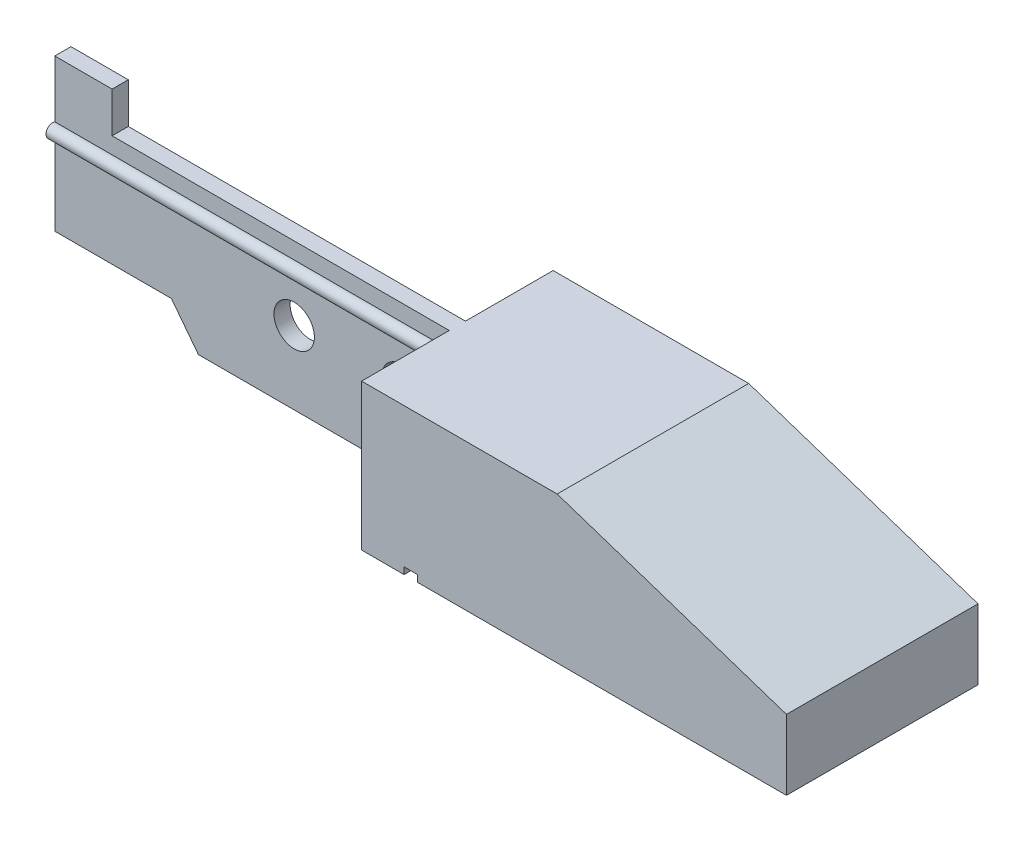
ISO-10303-21;
HEADER;
FILE_DESCRIPTION(('STEP AP214'),'2;1');
FILE_NAME('part.step','',(''),(''),'','','');
FILE_SCHEMA(('AUTOMOTIVE_DESIGN { 1 0 10303 214 1 1 1 1 }'));
ENDSEC;
DATA;
#1=APPLICATION_CONTEXT('core data for automotive mechanical design processes');
#2=APPLICATION_PROTOCOL_DEFINITION('international standard','automotive_design',2000,#1);
#3=PRODUCT_CONTEXT('',#1,'mechanical');
#4=PRODUCT('Part','Part','',(#3));
#5=PRODUCT_RELATED_PRODUCT_CATEGORY('part','',(#4));
#6=PRODUCT_DEFINITION_FORMATION('','',#4);
#7=PRODUCT_DEFINITION_CONTEXT('part definition',#1,'design');
#8=PRODUCT_DEFINITION('design','',#6,#7);
#9=PRODUCT_DEFINITION_SHAPE('','',#8);
#10=(LENGTH_UNIT() NAMED_UNIT(*) SI_UNIT(.MILLI.,.METRE.));
#11=(NAMED_UNIT(*) PLANE_ANGLE_UNIT() SI_UNIT($,.RADIAN.));
#12=(NAMED_UNIT(*) SI_UNIT($,.STERADIAN.) SOLID_ANGLE_UNIT());
#13=UNCERTAINTY_MEASURE_WITH_UNIT(LENGTH_MEASURE(1.E-05),#10,'distance_accuracy_value','');
#14=(GEOMETRIC_REPRESENTATION_CONTEXT(3) GLOBAL_UNCERTAINTY_ASSIGNED_CONTEXT((#13)) GLOBAL_UNIT_ASSIGNED_CONTEXT((#10,
#11,#12)) REPRESENTATION_CONTEXT('',''));
#15=CARTESIAN_POINT('',(0.,0.,0.));
#16=DIRECTION('',(0.,0.,1.));
#17=DIRECTION('',(1.,0.,0.));
#18=AXIS2_PLACEMENT_3D('',#15,#16,#17);
#19=CARTESIAN_POINT('',(-66.1286595394737,20.06375,7.7));
#20=DIRECTION('',(0.,0.,-1.));
#21=DIRECTION('',(0.,1.,0.));
#22=AXIS2_PLACEMENT_3D('',#19,#20,#21);
#23=PLANE('',#22);
#24=DIRECTION('',(1.,0.,0.));
#25=VECTOR('',#24,1.);
#26=CARTESIAN_POINT('',(-67.5428731018468,18.8407196007085,7.7));
#27=LINE('',#26,#25);
#28=CARTESIAN_POINT('',(-36.8786595394737,18.8407196007085,7.7));
#29=VERTEX_POINT('',#28);
#30=CARTESIAN_POINT('',(-66.1286595394737,18.8407196007085,7.7));
#31=VERTEX_POINT('',#30);
#32=EDGE_CURVE('E353',#29,#31,#27,.F.);
#33=ORIENTED_EDGE('',*,*,#32,.F.);
#34=DIRECTION('',(0.,1.,0.));
#35=VECTOR('',#34,1.);
#36=CARTESIAN_POINT('',(-36.8786595394737,20.06375,7.7));
#37=LINE('',#36,#35);
#38=CARTESIAN_POINT('',(-36.8786595394737,20.06375,7.7));
#39=VERTEX_POINT('',#38);
#40=EDGE_CURVE('E188',#29,#39,#37,.T.);
#41=ORIENTED_EDGE('',*,*,#40,.T.);
#42=DIRECTION('',(1.,0.,0.));
#43=VECTOR('',#42,1.);
#44=CARTESIAN_POINT('',(-66.1286595394737,20.06375,7.7));
#45=LINE('',#44,#43);
#46=CARTESIAN_POINT('',(-61.8772092607855,20.06375,7.7));
#47=VERTEX_POINT('',#46);
#48=EDGE_CURVE('E194',#47,#39,#45,.T.);
#49=ORIENTED_EDGE('',*,*,#48,.F.);
#50=DIRECTION('',(0.,-1.,0.));
#51=VECTOR('',#50,1.);
#52=CARTESIAN_POINT('',(-61.8772092607855,23.06375,7.7));
#53=LINE('',#52,#51);
#54=CARTESIAN_POINT('',(-61.8772092607855,23.06375,7.7));
#55=VERTEX_POINT('',#54);
#56=EDGE_CURVE('E191',#55,#47,#53,.T.);
#57=ORIENTED_EDGE('',*,*,#56,.F.);
#58=DIRECTION('',(1.,0.,0.));
#59=VECTOR('',#58,1.);
#60=CARTESIAN_POINT('',(-61.8772092607855,23.06375,7.7));
#61=LINE('',#60,#59);
#62=CARTESIAN_POINT('',(-66.1286595394737,23.06375,7.7));
#63=VERTEX_POINT('',#62);
#64=EDGE_CURVE('E311',#63,#55,#61,.T.);
#65=ORIENTED_EDGE('',*,*,#64,.F.);
#66=DIRECTION('',(0.,1.,0.));
#67=VECTOR('',#66,1.);
#68=CARTESIAN_POINT('',(-66.1286595394737,20.06375,7.7));
#69=LINE('',#68,#67);
#70=EDGE_CURVE('E182',#31,#63,#69,.T.);
#71=ORIENTED_EDGE('',*,*,#70,.F.);
#72=EDGE_LOOP('',(#33,#41,#49,#57,#65,#71));
#73=FACE_BOUND('',#72,.T.);
#74=ADVANCED_FACE('F34',(#73),#23,.F.);
#75=CARTESIAN_POINT('',(-48.3786595394737,14.63375,7.7));
#76=DIRECTION('',(0.,0.,-1.));
#77=DIRECTION('',(0.,1.,0.));
#78=AXIS2_PLACEMENT_3D('',#75,#76,#77);
#79=CIRCLE('',#78,1.5);
#80=CARTESIAN_POINT('',(-48.3786595394737,16.13375,7.7));
#81=VERTEX_POINT('',#80);
#82=EDGE_CURVE('E176',#81,#81,#79,.T.);
#83=ORIENTED_EDGE('',*,*,#82,.T.);
#84=EDGE_LOOP('',(#83));
#85=FACE_BOUND('',#84,.T.);
#86=CARTESIAN_POINT('',(-40.3786595394737,14.63375,7.7));
#87=DIRECTION('',(0.,0.,1.));
#88=DIRECTION('',(1.,0.,0.));
#89=AXIS2_PLACEMENT_3D('',#86,#87,#88);
#90=CIRCLE('',#89,1.5);
#91=CARTESIAN_POINT('',(-38.8786595394737,14.63375,7.7));
#92=VERTEX_POINT('',#91);
#93=EDGE_CURVE('E301',#92,#92,#90,.T.);
#94=ORIENTED_EDGE('',*,*,#93,.F.);
#95=EDGE_LOOP('',(#94));
#96=FACE_BOUND('',#95,.T.);
#97=DIRECTION('',(1.,0.,0.));
#98=VECTOR('',#97,1.);
#99=CARTESIAN_POINT('',(-66.1286595394737,11.81375,7.7));
#100=LINE('',#99,#98);
#101=CARTESIAN_POINT('',(-66.1286595394737,11.81375,7.7));
#102=VERTEX_POINT('',#101);
#103=CARTESIAN_POINT('',(-57.4786595394737,11.81375,7.7));
#104=VERTEX_POINT('',#103);
#105=EDGE_CURVE('E48',#102,#104,#100,.T.);
#106=ORIENTED_EDGE('',*,*,#105,.T.);
#107=DIRECTION('',(0.609710760849695,-0.792623989104598,0.));
#108=VECTOR('',#107,1.);
#109=CARTESIAN_POINT('',(-64.681261769957,21.1771328996282,7.7));
#110=LINE('',#109,#108);
#111=CARTESIAN_POINT('',(-55.4786595394737,9.21375,7.7));
#112=VERTEX_POINT('',#111);
#113=EDGE_CURVE('E363',#104,#112,#110,.T.);
#114=ORIENTED_EDGE('',*,*,#113,.T.);
#115=DIRECTION('',(1.,0.,0.));
#116=VECTOR('',#115,1.);
#117=CARTESIAN_POINT('',(-66.1286595394737,9.21375,7.7));
#118=LINE('',#117,#116);
#119=CARTESIAN_POINT('',(-36.8786595394737,9.21375,7.7));
#120=VERTEX_POINT('',#119);
#121=EDGE_CURVE('E200',#112,#120,#118,.T.);
#122=ORIENTED_EDGE('',*,*,#121,.T.);
#123=CARTESIAN_POINT('',(-36.8786595394737,17.8867803992915,7.7));
#124=VERTEX_POINT('',#123);
#125=EDGE_CURVE('E183',#120,#124,#37,.T.);
#126=ORIENTED_EDGE('',*,*,#125,.T.);
#127=DIRECTION('',(1.,0.,0.));
#128=VECTOR('',#127,1.);
#129=CARTESIAN_POINT('',(-67.5428731018468,17.8867803992915,7.7));
#130=LINE('',#129,#128);
#131=CARTESIAN_POINT('',(-66.1286595394737,17.8867803992915,7.7));
#132=VERTEX_POINT('',#131);
#133=EDGE_CURVE('E358',#132,#124,#130,.T.);
#134=ORIENTED_EDGE('',*,*,#133,.F.);
#135=EDGE_CURVE('E185',#102,#132,#69,.T.);
#136=ORIENTED_EDGE('',*,*,#135,.F.);
#137=EDGE_LOOP('',(#106,#114,#122,#126,#134,#136));
#138=FACE_BOUND('',#137,.T.);
#139=ADVANCED_FACE('F400',(#85,#96,#138),#23,.F.);
#140=CARTESIAN_POINT('',(-36.8786595394737,9.21375,14.2));
#141=DIRECTION('',(0.,1.,0.));
#142=DIRECTION('',(0.,0.,1.));
#143=AXIS2_PLACEMENT_3D('',#140,#141,#142);
#144=PLANE('',#143);
#145=ORIENTED_EDGE('',*,*,#121,.F.);
#146=DIRECTION('',(0.,0.,-1.));
#147=VECTOR('',#146,1.);
#148=CARTESIAN_POINT('',(-55.4786595394737,9.21375,16.5));
#149=LINE('',#148,#147);
#150=CARTESIAN_POINT('',(-55.4786595394737,9.21375,6.5));
#151=VERTEX_POINT('',#150);
#152=EDGE_CURVE('E367',#112,#151,#149,.T.);
#153=ORIENTED_EDGE('',*,*,#152,.T.);
#154=DIRECTION('',(1.,0.,0.));
#155=VECTOR('',#154,1.);
#156=CARTESIAN_POINT('',(-66.1286595394737,9.21375,6.5));
#157=LINE('',#156,#155);
#158=CARTESIAN_POINT('',(-36.8786595394737,9.21375,6.5));
#159=VERTEX_POINT('',#158);
#160=EDGE_CURVE('E202',#151,#159,#157,.T.);
#161=ORIENTED_EDGE('',*,*,#160,.T.);
#162=DIRECTION('',(0.,0.,-1.));
#163=VECTOR('',#162,1.);
#164=CARTESIAN_POINT('',(-36.8786595394737,9.21375,14.2));
#165=LINE('',#164,#163);
#166=CARTESIAN_POINT('',(-36.8786595394737,9.21375,0.));
#167=VERTEX_POINT('',#166);
#168=EDGE_CURVE('E245',#159,#167,#165,.T.);
#169=ORIENTED_EDGE('',*,*,#168,.T.);
#170=DIRECTION('',(1.,0.,0.));
#171=VECTOR('',#170,1.);
#172=CARTESIAN_POINT('',(-36.8786595394737,9.21375,0.));
#173=LINE('',#172,#171);
#174=CARTESIAN_POINT('',(-33.7292463448552,9.21375,0.));
#175=VERTEX_POINT('',#174);
#176=EDGE_CURVE('E225',#167,#175,#173,.T.);
#177=ORIENTED_EDGE('',*,*,#176,.T.);
#178=DIRECTION('',(0.,0.,-1.));
#179=VECTOR('',#178,1.);
#180=CARTESIAN_POINT('',(-33.7292463448552,9.21375,6.36936480338992));
#181=LINE('',#180,#179);
#182=CARTESIAN_POINT('',(-33.7292463448552,9.21375,14.2));
#183=VERTEX_POINT('',#182);
#184=EDGE_CURVE('E352',#183,#175,#181,.T.);
#185=ORIENTED_EDGE('',*,*,#184,.F.);
#186=DIRECTION('',(1.,0.,0.));
#187=VECTOR('',#186,1.);
#188=CARTESIAN_POINT('',(-36.8786595394737,9.21375,14.2));
#189=LINE('',#188,#187);
#190=CARTESIAN_POINT('',(-36.8786595394737,9.21375,14.2));
#191=VERTEX_POINT('',#190);
#192=EDGE_CURVE('E212',#191,#183,#189,.T.);
#193=ORIENTED_EDGE('',*,*,#192,.F.);
#194=EDGE_CURVE('E42',#191,#120,#165,.T.);
#195=ORIENTED_EDGE('',*,*,#194,.T.);
#196=EDGE_LOOP('',(#145,#153,#161,#169,#177,#185,#193,#195));
#197=FACE_BOUND('',#196,.T.);
#198=ADVANCED_FACE('F252',(#197),#144,.F.);
#199=CARTESIAN_POINT('',(-36.8786595394737,20.06375,14.2));
#200=DIRECTION('',(0.,-1.,0.));
#201=DIRECTION('',(0.,0.,-1.));
#202=AXIS2_PLACEMENT_3D('',#199,#200,#201);
#203=PLANE('',#202);
#204=DIRECTION('',(0.,0.,-1.));
#205=VECTOR('',#204,1.);
#206=CARTESIAN_POINT('',(-61.8772092607855,20.06375,7.7));
#207=LINE('',#206,#205);
#208=CARTESIAN_POINT('',(-61.8772092607855,20.06375,6.5));
#209=VERTEX_POINT('',#208);
#210=EDGE_CURVE('E307',#47,#209,#207,.T.);
#211=ORIENTED_EDGE('',*,*,#210,.F.);
#212=ORIENTED_EDGE('',*,*,#48,.T.);
#213=DIRECTION('',(0.,0.,-1.));
#214=VECTOR('',#213,1.);
#215=CARTESIAN_POINT('',(-36.8786595394737,20.06375,14.2));
#216=LINE('',#215,#214);
#217=CARTESIAN_POINT('',(-36.8786595394737,20.06375,14.2));
#218=VERTEX_POINT('',#217);
#219=EDGE_CURVE('E234',#218,#39,#216,.T.);
#220=ORIENTED_EDGE('',*,*,#219,.F.);
#221=DIRECTION('',(-1.,0.,0.));
#222=VECTOR('',#221,1.);
#223=CARTESIAN_POINT('',(-36.8786595394737,20.06375,14.2));
#224=LINE('',#223,#222);
#225=CARTESIAN_POINT('',(-22.3786595394737,20.06375,14.2));
#226=VERTEX_POINT('',#225);
#227=EDGE_CURVE('E219',#226,#218,#224,.T.);
#228=ORIENTED_EDGE('',*,*,#227,.F.);
#229=DIRECTION('',(0.,0.,-1.));
#230=VECTOR('',#229,1.);
#231=CARTESIAN_POINT('',(-22.3786595394737,20.06375,14.2));
#232=LINE('',#231,#230);
#233=CARTESIAN_POINT('',(-22.3786595394737,20.06375,0.));
#234=VERTEX_POINT('',#233);
#235=EDGE_CURVE('E237',#226,#234,#232,.T.);
#236=ORIENTED_EDGE('',*,*,#235,.T.);
#237=DIRECTION('',(-1.,0.,0.));
#238=VECTOR('',#237,1.);
#239=CARTESIAN_POINT('',(-36.8786595394737,20.06375,0.));
#240=LINE('',#239,#238);
#241=CARTESIAN_POINT('',(-36.8786595394737,20.06375,0.));
#242=VERTEX_POINT('',#241);
#243=EDGE_CURVE('E211',#234,#242,#240,.T.);
#244=ORIENTED_EDGE('',*,*,#243,.T.);
#245=CARTESIAN_POINT('',(-36.8786595394737,20.06375,6.5));
#246=VERTEX_POINT('',#245);
#247=EDGE_CURVE('E221',#246,#242,#216,.T.);
#248=ORIENTED_EDGE('',*,*,#247,.F.);
#249=DIRECTION('',(1.,0.,0.));
#250=VECTOR('',#249,1.);
#251=CARTESIAN_POINT('',(-66.1286595394737,20.06375,6.5));
#252=LINE('',#251,#250);
#253=EDGE_CURVE('E204',#209,#246,#252,.T.);
#254=ORIENTED_EDGE('',*,*,#253,.F.);
#255=EDGE_LOOP('',(#211,#212,#220,#228,#236,#244,#248,#254));
#256=FACE_BOUND('',#255,.T.);
#257=ADVANCED_FACE('F268',(#256),#203,.F.);
#258=CARTESIAN_POINT('',(-36.8786595394737,9.21375,14.2));
#259=DIRECTION('',(1.,0.,0.));
#260=DIRECTION('',(0.,0.,-1.));
#261=AXIS2_PLACEMENT_3D('',#258,#259,#260);
#262=PLANE('',#261);
#263=CARTESIAN_POINT('',(-36.8786595394737,18.36375,7.85));
#264=DIRECTION('',(-1.,0.,0.));
#265=DIRECTION('',(0.,0.,1.));
#266=AXIS2_PLACEMENT_3D('',#263,#264,#265);
#267=CIRCLE('',#266,0.500000000000001);
#268=EDGE_CURVE('E361',#124,#29,#267,.T.);
#269=ORIENTED_EDGE('',*,*,#268,.F.);
#270=ORIENTED_EDGE('',*,*,#125,.F.);
#271=ORIENTED_EDGE('',*,*,#194,.F.);
#272=DIRECTION('',(0.,-1.,0.));
#273=VECTOR('',#272,1.);
#274=CARTESIAN_POINT('',(-36.8786595394737,9.21375,14.2));
#275=LINE('',#274,#273);
#276=EDGE_CURVE('E207',#218,#191,#275,.T.);
#277=ORIENTED_EDGE('',*,*,#276,.F.);
#278=ORIENTED_EDGE('',*,*,#219,.T.);
#279=ORIENTED_EDGE('',*,*,#40,.F.);
#280=EDGE_LOOP('',(#269,#270,#271,#277,#278,#279));
#281=FACE_BOUND('',#280,.T.);
#282=ADVANCED_FACE('F36',(#281),#262,.F.);
#283=DIRECTION('',(0.,-1.,0.));
#284=VECTOR('',#283,1.);
#285=CARTESIAN_POINT('',(-36.8786595394737,20.06375,6.5));
#286=LINE('',#285,#284);
#287=EDGE_CURVE('E195',#246,#159,#286,.T.);
#288=ORIENTED_EDGE('',*,*,#287,.F.);
#289=ORIENTED_EDGE('',*,*,#247,.T.);
#290=DIRECTION('',(0.,-1.,0.));
#291=VECTOR('',#290,1.);
#292=CARTESIAN_POINT('',(-36.8786595394737,9.21375,0.));
#293=LINE('',#292,#291);
#294=EDGE_CURVE('E206',#242,#167,#293,.T.);
#295=ORIENTED_EDGE('',*,*,#294,.T.);
#296=ORIENTED_EDGE('',*,*,#168,.F.);
#297=EDGE_LOOP('',(#288,#289,#295,#296));
#298=FACE_BOUND('',#297,.T.);
#299=ADVANCED_FACE('F265',(#298),#262,.F.);
#300=CARTESIAN_POINT('',(-32.7292463448552,9.21375,14.2));
#301=VERTEX_POINT('',#300);
#302=CARTESIAN_POINT('',(-5.37865953947368,9.21375,14.2));
#303=VERTEX_POINT('',#302);
#304=EDGE_CURVE('E210',#301,#303,#189,.T.);
#305=ORIENTED_EDGE('',*,*,#304,.F.);
#306=DIRECTION('',(0.,0.,1.));
#307=VECTOR('',#306,1.);
#308=CARTESIAN_POINT('',(-32.7292463448552,9.21375,14.2));
#309=LINE('',#308,#307);
#310=CARTESIAN_POINT('',(-32.7292463448552,9.21375,0.));
#311=VERTEX_POINT('',#310);
#312=EDGE_CURVE('E286',#311,#301,#309,.T.);
#313=ORIENTED_EDGE('',*,*,#312,.F.);
#314=CARTESIAN_POINT('',(-5.37865953947368,9.21375,0.));
#315=VERTEX_POINT('',#314);
#316=EDGE_CURVE('E224',#311,#315,#173,.T.);
#317=ORIENTED_EDGE('',*,*,#316,.T.);
#318=DIRECTION('',(0.,0.,-1.));
#319=VECTOR('',#318,1.);
#320=CARTESIAN_POINT('',(-5.37865953947368,9.21375,14.2));
#321=LINE('',#320,#319);
#322=EDGE_CURVE('E243',#303,#315,#321,.T.);
#323=ORIENTED_EDGE('',*,*,#322,.F.);
#324=EDGE_LOOP('',(#305,#313,#317,#323));
#325=FACE_BOUND('',#324,.T.);
#326=ADVANCED_FACE('F284',(#325),#144,.F.);
#327=CARTESIAN_POINT('',(-5.37865953947368,9.21375,14.2));
#328=DIRECTION('',(-1.,0.,0.));
#329=DIRECTION('',(0.,0.,1.));
#330=AXIS2_PLACEMENT_3D('',#327,#328,#329);
#331=PLANE('',#330);
#332=DIRECTION('',(0.,1.,0.));
#333=VECTOR('',#332,1.);
#334=CARTESIAN_POINT('',(-5.37865953947368,9.21375,0.));
#335=LINE('',#334,#333);
#336=CARTESIAN_POINT('',(-5.37865953947368,14.41375,0.));
#337=VERTEX_POINT('',#336);
#338=EDGE_CURVE('E228',#315,#337,#335,.T.);
#339=ORIENTED_EDGE('',*,*,#338,.T.);
#340=DIRECTION('',(0.,0.,-1.));
#341=VECTOR('',#340,1.);
#342=CARTESIAN_POINT('',(-5.37865953947368,14.41375,14.2));
#343=LINE('',#342,#341);
#344=CARTESIAN_POINT('',(-5.37865953947368,14.41375,14.2));
#345=VERTEX_POINT('',#344);
#346=EDGE_CURVE('E240',#345,#337,#343,.T.);
#347=ORIENTED_EDGE('',*,*,#346,.F.);
#348=DIRECTION('',(0.,1.,0.));
#349=VECTOR('',#348,1.);
#350=CARTESIAN_POINT('',(-5.37865953947368,9.21375,14.2));
#351=LINE('',#350,#349);
#352=EDGE_CURVE('E215',#303,#345,#351,.T.);
#353=ORIENTED_EDGE('',*,*,#352,.F.);
#354=ORIENTED_EDGE('',*,*,#322,.T.);
#355=EDGE_LOOP('',(#339,#347,#353,#354));
#356=FACE_BOUND('',#355,.T.);
#357=ADVANCED_FACE('F280',(#356),#331,.F.);
#358=CARTESIAN_POINT('',(-22.3786595394737,20.06375,14.2));
#359=DIRECTION('',(-0.31539032340276,-0.948962035017156,0.));
#360=DIRECTION('',(0.948962035017156,-0.31539032340276,0.));
#361=AXIS2_PLACEMENT_3D('',#358,#359,#360);
#362=PLANE('',#361);
#363=DIRECTION('',(-0.948962035017156,0.31539032340276,0.));
#364=VECTOR('',#363,1.);
#365=CARTESIAN_POINT('',(-22.3786595394737,20.06375,0.));
#366=LINE('',#365,#364);
#367=EDGE_CURVE('E230',#337,#234,#366,.T.);
#368=ORIENTED_EDGE('',*,*,#367,.T.);
#369=ORIENTED_EDGE('',*,*,#235,.F.);
#370=DIRECTION('',(-0.948962035017156,0.31539032340276,0.));
#371=VECTOR('',#370,1.);
#372=CARTESIAN_POINT('',(-22.3786595394737,20.06375,14.2));
#373=LINE('',#372,#371);
#374=EDGE_CURVE('E217',#345,#226,#373,.T.);
#375=ORIENTED_EDGE('',*,*,#374,.F.);
#376=ORIENTED_EDGE('',*,*,#346,.T.);
#377=EDGE_LOOP('',(#368,#369,#375,#376));
#378=FACE_BOUND('',#377,.T.);
#379=ADVANCED_FACE('F275',(#378),#362,.F.);
#380=CARTESIAN_POINT('',(0.,0.,14.2));
#381=DIRECTION('',(0.,0.,-1.));
#382=DIRECTION('',(-1.,0.,0.));
#383=AXIS2_PLACEMENT_3D('',#380,#381,#382);
#384=PLANE('',#383);
#385=ORIENTED_EDGE('',*,*,#192,.T.);
#386=DIRECTION('',(0.,-1.,0.));
#387=VECTOR('',#386,1.);
#388=CARTESIAN_POINT('',(-33.7292463448552,9.71375,14.2));
#389=LINE('',#388,#387);
#390=CARTESIAN_POINT('',(-33.7292463448552,9.71375,14.2));
#391=VERTEX_POINT('',#390);
#392=EDGE_CURVE('E295',#391,#183,#389,.T.);
#393=ORIENTED_EDGE('',*,*,#392,.F.);
#394=DIRECTION('',(-1.,0.,0.));
#395=VECTOR('',#394,1.);
#396=CARTESIAN_POINT('',(-33.7292463448552,9.71375,14.2));
#397=LINE('',#396,#395);
#398=CARTESIAN_POINT('',(-32.7292463448552,9.71375,14.2));
#399=VERTEX_POINT('',#398);
#400=EDGE_CURVE('E297',#399,#391,#397,.T.);
#401=ORIENTED_EDGE('',*,*,#400,.F.);
#402=DIRECTION('',(0.,-1.,0.));
#403=VECTOR('',#402,1.);
#404=CARTESIAN_POINT('',(-32.7292463448552,9.71375,14.2));
#405=LINE('',#404,#403);
#406=EDGE_CURVE('E292',#399,#301,#405,.T.);
#407=ORIENTED_EDGE('',*,*,#406,.T.);
#408=ORIENTED_EDGE('',*,*,#304,.T.);
#409=ORIENTED_EDGE('',*,*,#352,.T.);
#410=ORIENTED_EDGE('',*,*,#374,.T.);
#411=ORIENTED_EDGE('',*,*,#227,.T.);
#412=ORIENTED_EDGE('',*,*,#276,.T.);
#413=EDGE_LOOP('',(#385,#393,#401,#407,#408,#409,#410,#411,#412));
#414=FACE_BOUND('',#413,.T.);
#415=ADVANCED_FACE('F336',(#414),#384,.F.);
#416=CARTESIAN_POINT('',(0.,0.,0.));
#417=DIRECTION('',(0.,0.,-1.));
#418=DIRECTION('',(-1.,0.,0.));
#419=AXIS2_PLACEMENT_3D('',#416,#417,#418);
#420=PLANE('',#419);
#421=DIRECTION('',(0.,-1.,0.));
#422=VECTOR('',#421,1.);
#423=CARTESIAN_POINT('',(-33.7292463448552,9.71375,0.));
#424=LINE('',#423,#422);
#425=CARTESIAN_POINT('',(-33.7292463448552,9.71375,0.));
#426=VERTEX_POINT('',#425);
#427=EDGE_CURVE('E264',#426,#175,#424,.T.);
#428=ORIENTED_EDGE('',*,*,#427,.T.);
#429=ORIENTED_EDGE('',*,*,#176,.F.);
#430=ORIENTED_EDGE('',*,*,#294,.F.);
#431=ORIENTED_EDGE('',*,*,#243,.F.);
#432=ORIENTED_EDGE('',*,*,#367,.F.);
#433=ORIENTED_EDGE('',*,*,#338,.F.);
#434=ORIENTED_EDGE('',*,*,#316,.F.);
#435=DIRECTION('',(0.,-1.,0.));
#436=VECTOR('',#435,1.);
#437=CARTESIAN_POINT('',(-32.7292463448552,9.71375,0.));
#438=LINE('',#437,#436);
#439=CARTESIAN_POINT('',(-32.7292463448552,9.71375,0.));
#440=VERTEX_POINT('',#439);
#441=EDGE_CURVE('E288',#440,#311,#438,.T.);
#442=ORIENTED_EDGE('',*,*,#441,.F.);
#443=DIRECTION('',(1.,0.,0.));
#444=VECTOR('',#443,1.);
#445=CARTESIAN_POINT('',(-32.7292463448552,9.71375,0.));
#446=LINE('',#445,#444);
#447=EDGE_CURVE('E290',#426,#440,#446,.T.);
#448=ORIENTED_EDGE('',*,*,#447,.F.);
#449=EDGE_LOOP('',(#428,#429,#430,#431,#432,#433,#434,#442,#448));
#450=FACE_BOUND('',#449,.T.);
#451=ADVANCED_FACE('F260',(#450),#420,.T.);
#452=CARTESIAN_POINT('',(-66.1286595394737,20.06375,6.5));
#453=DIRECTION('',(0.,0.,1.));
#454=DIRECTION('',(1.,0.,0.));
#455=AXIS2_PLACEMENT_3D('',#452,#453,#454);
#456=PLANE('',#455);
#457=CARTESIAN_POINT('',(-48.3786595394737,14.63375,6.5));
#458=DIRECTION('',(0.,0.,-1.));
#459=DIRECTION('',(-1.,0.,0.));
#460=AXIS2_PLACEMENT_3D('',#457,#458,#459);
#461=CIRCLE('',#460,1.5);
#462=CARTESIAN_POINT('',(-49.8786595394737,14.63375,6.5));
#463=VERTEX_POINT('',#462);
#464=EDGE_CURVE('E374',#463,#463,#461,.T.);
#465=ORIENTED_EDGE('',*,*,#464,.F.);
#466=EDGE_LOOP('',(#465));
#467=FACE_BOUND('',#466,.T.);
#468=CARTESIAN_POINT('',(-40.3786595394737,14.63375,6.5));
#469=DIRECTION('',(0.,0.,1.));
#470=DIRECTION('',(1.,0.,0.));
#471=AXIS2_PLACEMENT_3D('',#468,#469,#470);
#472=CIRCLE('',#471,1.5);
#473=CARTESIAN_POINT('',(-38.8786595394737,14.63375,6.5));
#474=VERTEX_POINT('',#473);
#475=EDGE_CURVE('E304',#474,#474,#472,.T.);
#476=ORIENTED_EDGE('',*,*,#475,.T.);
#477=EDGE_LOOP('',(#476));
#478=FACE_BOUND('',#477,.T.);
#479=ORIENTED_EDGE('',*,*,#160,.F.);
#480=DIRECTION('',(0.609710760849695,-0.792623989104598,0.));
#481=VECTOR('',#480,1.);
#482=CARTESIAN_POINT('',(-57.4786595394737,11.81375,6.5));
#483=LINE('',#482,#481);
#484=CARTESIAN_POINT('',(-57.4786595394737,11.81375,6.5));
#485=VERTEX_POINT('',#484);
#486=EDGE_CURVE('E175',#485,#151,#483,.T.);
#487=ORIENTED_EDGE('',*,*,#486,.F.);
#488=DIRECTION('',(1.,0.,0.));
#489=VECTOR('',#488,1.);
#490=CARTESIAN_POINT('',(-66.1286595394737,11.81375,6.5));
#491=LINE('',#490,#489);
#492=CARTESIAN_POINT('',(-66.1286595394737,11.81375,6.5));
#493=VERTEX_POINT('',#492);
#494=EDGE_CURVE('E165',#493,#485,#491,.T.);
#495=ORIENTED_EDGE('',*,*,#494,.F.);
#496=DIRECTION('',(0.,-1.,0.));
#497=VECTOR('',#496,1.);
#498=CARTESIAN_POINT('',(-66.1286595394737,20.06375,6.5));
#499=LINE('',#498,#497);
#500=CARTESIAN_POINT('',(-66.1286595394737,23.06375,6.5));
#501=VERTEX_POINT('',#500);
#502=EDGE_CURVE('E173',#501,#493,#499,.T.);
#503=ORIENTED_EDGE('',*,*,#502,.F.);
#504=DIRECTION('',(-1.,0.,0.));
#505=VECTOR('',#504,1.);
#506=CARTESIAN_POINT('',(-61.8772092607855,23.06375,6.5));
#507=LINE('',#506,#505);
#508=CARTESIAN_POINT('',(-61.8772092607855,23.06375,6.5));
#509=VERTEX_POINT('',#508);
#510=EDGE_CURVE('E308',#509,#501,#507,.T.);
#511=ORIENTED_EDGE('',*,*,#510,.F.);
#512=DIRECTION('',(0.,-1.,0.));
#513=VECTOR('',#512,1.);
#514=CARTESIAN_POINT('',(-61.8772092607855,23.06375,6.5));
#515=LINE('',#514,#513);
#516=EDGE_CURVE('E315',#509,#209,#515,.T.);
#517=ORIENTED_EDGE('',*,*,#516,.T.);
#518=ORIENTED_EDGE('',*,*,#253,.T.);
#519=ORIENTED_EDGE('',*,*,#287,.T.);
#520=EDGE_LOOP('',(#479,#487,#495,#503,#511,#517,#518,#519));
#521=FACE_BOUND('',#520,.T.);
#522=ADVANCED_FACE('F171',(#467,#478,#521),#456,.F.);
#523=CARTESIAN_POINT('',(-66.1286595394737,0.,0.));
#524=DIRECTION('',(-1.,0.,0.));
#525=DIRECTION('',(0.,0.,1.));
#526=AXIS2_PLACEMENT_3D('',#523,#524,#525);
#527=PLANE('',#526);
#528=DIRECTION('',(0.,0.,-1.));
#529=VECTOR('',#528,1.);
#530=CARTESIAN_POINT('',(-66.1286595394737,11.81375,0.));
#531=LINE('',#530,#529);
#532=EDGE_CURVE('E11',#102,#493,#531,.T.);
#533=ORIENTED_EDGE('',*,*,#532,.F.);
#534=ORIENTED_EDGE('',*,*,#135,.T.);
#535=CARTESIAN_POINT('',(-66.1286595394737,18.36375,7.85));
#536=DIRECTION('',(-1.,0.,0.));
#537=DIRECTION('',(0.,0.,1.));
#538=AXIS2_PLACEMENT_3D('',#535,#536,#537);
#539=CIRCLE('',#538,0.500000000000001);
#540=EDGE_CURVE('E56',#132,#31,#539,.T.);
#541=ORIENTED_EDGE('',*,*,#540,.T.);
#542=ORIENTED_EDGE('',*,*,#70,.T.);
#543=DIRECTION('',(0.,0.,1.));
#544=VECTOR('',#543,1.);
#545=CARTESIAN_POINT('',(-66.1286595394737,23.06375,6.5));
#546=LINE('',#545,#544);
#547=EDGE_CURVE('E180',#501,#63,#546,.T.);
#548=ORIENTED_EDGE('',*,*,#547,.F.);
#549=ORIENTED_EDGE('',*,*,#502,.T.);
#550=EDGE_LOOP('',(#533,#534,#541,#542,#548,#549));
#551=FACE_BOUND('',#550,.T.);
#552=ADVANCED_FACE('F178',(#551),#527,.T.);
#553=CARTESIAN_POINT('',(-61.8772092607855,23.06375,7.7));
#554=DIRECTION('',(-1.,0.,0.));
#555=DIRECTION('',(0.,0.,1.));
#556=AXIS2_PLACEMENT_3D('',#553,#554,#555);
#557=PLANE('',#556);
#558=ORIENTED_EDGE('',*,*,#210,.T.);
#559=ORIENTED_EDGE('',*,*,#516,.F.);
#560=DIRECTION('',(0.,0.,-1.));
#561=VECTOR('',#560,1.);
#562=CARTESIAN_POINT('',(-61.8772092607855,23.06375,7.7));
#563=LINE('',#562,#561);
#564=EDGE_CURVE('E313',#55,#509,#563,.T.);
#565=ORIENTED_EDGE('',*,*,#564,.F.);
#566=ORIENTED_EDGE('',*,*,#56,.T.);
#567=EDGE_LOOP('',(#558,#559,#565,#566));
#568=FACE_BOUND('',#567,.T.);
#569=ADVANCED_FACE('F323',(#568),#557,.F.);
#570=CARTESIAN_POINT('',(0.,23.06375,0.));
#571=DIRECTION('',(0.,1.,0.));
#572=DIRECTION('',(0.,0.,1.));
#573=AXIS2_PLACEMENT_3D('',#570,#571,#572);
#574=PLANE('',#573);
#575=ORIENTED_EDGE('',*,*,#510,.T.);
#576=ORIENTED_EDGE('',*,*,#547,.T.);
#577=ORIENTED_EDGE('',*,*,#64,.T.);
#578=ORIENTED_EDGE('',*,*,#564,.T.);
#579=EDGE_LOOP('',(#575,#576,#577,#578));
#580=FACE_BOUND('',#579,.T.);
#581=ADVANCED_FACE('F388',(#580),#574,.T.);
#582=CARTESIAN_POINT('',(-40.3786595394737,14.63375,-2.3));
#583=DIRECTION('',(0.,0.,1.));
#584=DIRECTION('',(1.,0.,0.));
#585=AXIS2_PLACEMENT_3D('',#582,#583,#584);
#586=CYLINDRICAL_SURFACE('',#585,1.5);
#587=ORIENTED_EDGE('',*,*,#93,.T.);
#588=EDGE_LOOP('',(#587));
#589=FACE_BOUND('',#588,.T.);
#590=ORIENTED_EDGE('',*,*,#475,.F.);
#591=EDGE_LOOP('',(#590));
#592=FACE_BOUND('',#591,.T.);
#593=ADVANCED_FACE('F386',(#589,#592),#586,.F.);
#594=CARTESIAN_POINT('',(-33.7292463448552,9.71375,6.36936480338992));
#595=DIRECTION('',(-1.,0.,0.));
#596=DIRECTION('',(0.,0.,1.));
#597=AXIS2_PLACEMENT_3D('',#594,#595,#596);
#598=PLANE('',#597);
#599=ORIENTED_EDGE('',*,*,#184,.T.);
#600=ORIENTED_EDGE('',*,*,#427,.F.);
#601=DIRECTION('',(0.,0.,-1.));
#602=VECTOR('',#601,1.);
#603=CARTESIAN_POINT('',(-33.7292463448552,9.71375,0.));
#604=LINE('',#603,#602);
#605=EDGE_CURVE('E347',#391,#426,#604,.T.);
#606=ORIENTED_EDGE('',*,*,#605,.F.);
#607=ORIENTED_EDGE('',*,*,#392,.T.);
#608=EDGE_LOOP('',(#599,#600,#606,#607));
#609=FACE_BOUND('',#608,.T.);
#610=ADVANCED_FACE('F355',(#609),#598,.F.);
#611=CARTESIAN_POINT('',(-32.7292463448552,9.71375,14.2));
#612=DIRECTION('',(1.,0.,0.));
#613=DIRECTION('',(0.,0.,-1.));
#614=AXIS2_PLACEMENT_3D('',#611,#612,#613);
#615=PLANE('',#614);
#616=ORIENTED_EDGE('',*,*,#312,.T.);
#617=ORIENTED_EDGE('',*,*,#406,.F.);
#618=DIRECTION('',(0.,0.,1.));
#619=VECTOR('',#618,1.);
#620=CARTESIAN_POINT('',(-32.7292463448552,9.71375,14.2));
#621=LINE('',#620,#619);
#622=EDGE_CURVE('E342',#440,#399,#621,.T.);
#623=ORIENTED_EDGE('',*,*,#622,.F.);
#624=ORIENTED_EDGE('',*,*,#441,.T.);
#625=EDGE_LOOP('',(#616,#617,#623,#624));
#626=FACE_BOUND('',#625,.T.);
#627=ADVANCED_FACE('F341',(#626),#615,.F.);
#628=CARTESIAN_POINT('',(0.,9.71375,0.));
#629=DIRECTION('',(0.,1.,0.));
#630=DIRECTION('',(0.,0.,1.));
#631=AXIS2_PLACEMENT_3D('',#628,#629,#630);
#632=PLANE('',#631);
#633=ORIENTED_EDGE('',*,*,#605,.T.);
#634=ORIENTED_EDGE('',*,*,#447,.T.);
#635=ORIENTED_EDGE('',*,*,#622,.T.);
#636=ORIENTED_EDGE('',*,*,#400,.T.);
#637=EDGE_LOOP('',(#633,#634,#635,#636));
#638=FACE_BOUND('',#637,.T.);
#639=ADVANCED_FACE('F344',(#638),#632,.F.);
#640=CARTESIAN_POINT('',(-67.5428731018468,18.36375,7.85));
#641=DIRECTION('',(1.,0.,0.));
#642=DIRECTION('',(0.,0.,-1.));
#643=AXIS2_PLACEMENT_3D('',#640,#641,#642);
#644=CYLINDRICAL_SURFACE('',#643,0.500000000000001);
#645=ORIENTED_EDGE('',*,*,#268,.T.);
#646=ORIENTED_EDGE('',*,*,#32,.T.);
#647=ORIENTED_EDGE('',*,*,#540,.F.);
#648=ORIENTED_EDGE('',*,*,#133,.T.);
#649=EDGE_LOOP('',(#645,#646,#647,#648));
#650=FACE_BOUND('',#649,.T.);
#651=ADVANCED_FACE('F535',(#650),#644,.T.);
#652=CARTESIAN_POINT('',(-57.4786595394737,11.81375,16.5));
#653=DIRECTION('',(0.792623989104598,0.609710760849695,0.));
#654=DIRECTION('',(-0.609710760849695,0.792623989104598,0.));
#655=AXIS2_PLACEMENT_3D('',#652,#653,#654);
#656=PLANE('',#655);
#657=DIRECTION('',(0.,0.,-1.));
#658=VECTOR('',#657,1.);
#659=CARTESIAN_POINT('',(-57.4786595394737,11.81375,16.5));
#660=LINE('',#659,#658);
#661=EDGE_CURVE('E368',#104,#485,#660,.T.);
#662=ORIENTED_EDGE('',*,*,#661,.T.);
#663=ORIENTED_EDGE('',*,*,#486,.T.);
#664=ORIENTED_EDGE('',*,*,#152,.F.);
#665=ORIENTED_EDGE('',*,*,#113,.F.);
#666=EDGE_LOOP('',(#662,#663,#664,#665));
#667=FACE_BOUND('',#666,.T.);
#668=ADVANCED_FACE('F567',(#667),#656,.F.);
#669=CARTESIAN_POINT('',(-66.1286595394737,11.81375,16.5));
#670=DIRECTION('',(0.,1.,0.));
#671=DIRECTION('',(0.,0.,1.));
#672=AXIS2_PLACEMENT_3D('',#669,#670,#671);
#673=PLANE('',#672);
#674=ORIENTED_EDGE('',*,*,#532,.T.);
#675=ORIENTED_EDGE('',*,*,#494,.T.);
#676=ORIENTED_EDGE('',*,*,#661,.F.);
#677=ORIENTED_EDGE('',*,*,#105,.F.);
#678=EDGE_LOOP('',(#674,#675,#676,#677));
#679=FACE_BOUND('',#678,.T.);
#680=ADVANCED_FACE('F164',(#679),#673,.F.);
#681=CARTESIAN_POINT('',(-48.3786595394737,14.63375,16.5));
#682=DIRECTION('',(0.,0.,-1.));
#683=DIRECTION('',(-1.,0.,0.));
#684=AXIS2_PLACEMENT_3D('',#681,#682,#683);
#685=CYLINDRICAL_SURFACE('',#684,1.5);
#686=ORIENTED_EDGE('',*,*,#464,.T.);
#687=EDGE_LOOP('',(#686));
#688=FACE_BOUND('',#687,.T.);
#689=ORIENTED_EDGE('',*,*,#82,.F.);
#690=EDGE_LOOP('',(#689));
#691=FACE_BOUND('',#690,.T.);
#692=ADVANCED_FACE('F378',(#688,#691),#685,.F.);
#693=CLOSED_SHELL('',(#74,#139,#198,#257,#282,#299,#326,#357,#379,#415,#451,#522,#552,#569,#581,
#593,#610,#627,#639,#651,#668,#680,#692));
#694=MANIFOLD_SOLID_BREP('B2',#693);
#695=ADVANCED_BREP_SHAPE_REPRESENTATION('',(#18,#694),#14);
#696=SHAPE_DEFINITION_REPRESENTATION(#9,#695);
ENDSEC;
END-ISO-10303-21;
